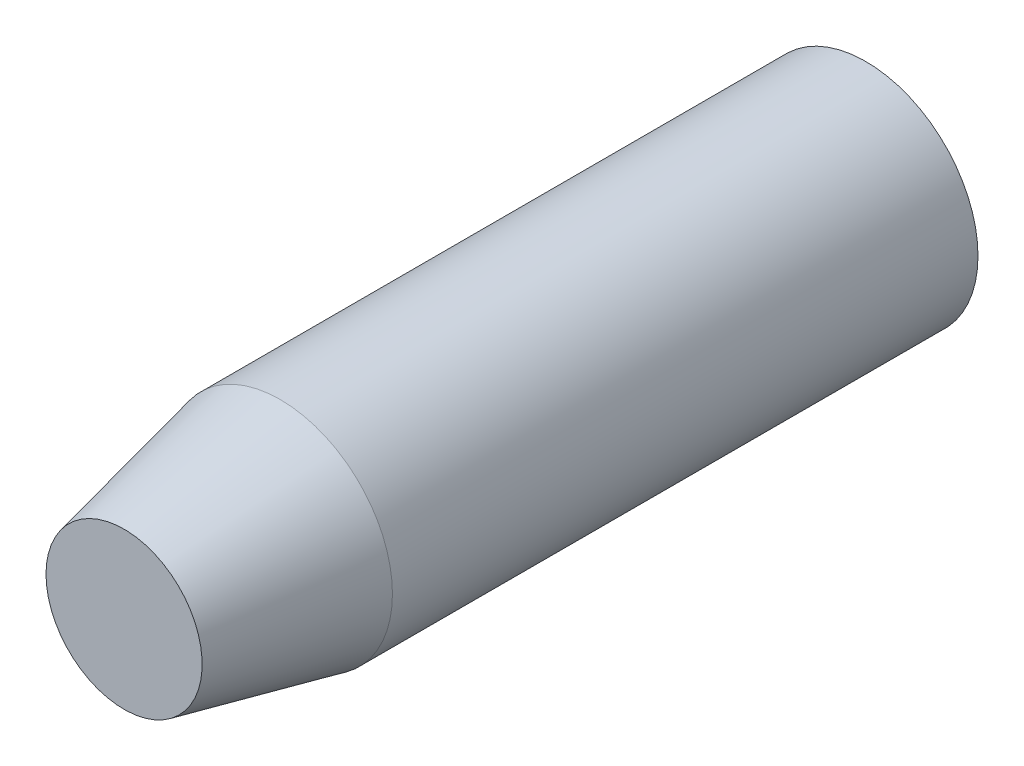
ISO-10303-21;
HEADER;
FILE_DESCRIPTION(('STEP AP214'),'2;1');
FILE_NAME('part.step','',(''),(''),'','','');
FILE_SCHEMA(('AUTOMOTIVE_DESIGN { 1 0 10303 214 1 1 1 1 }'));
ENDSEC;
DATA;
#1=APPLICATION_CONTEXT('core data for automotive mechanical design processes');
#2=APPLICATION_PROTOCOL_DEFINITION('international standard','automotive_design',2000,#1);
#3=PRODUCT_CONTEXT('',#1,'mechanical');
#4=PRODUCT('Part','Part','',(#3));
#5=PRODUCT_RELATED_PRODUCT_CATEGORY('part','',(#4));
#6=PRODUCT_DEFINITION_FORMATION('','',#4);
#7=PRODUCT_DEFINITION_CONTEXT('part definition',#1,'design');
#8=PRODUCT_DEFINITION('design','',#6,#7);
#9=PRODUCT_DEFINITION_SHAPE('','',#8);
#10=(LENGTH_UNIT() NAMED_UNIT(*) SI_UNIT(.MILLI.,.METRE.));
#11=(NAMED_UNIT(*) PLANE_ANGLE_UNIT() SI_UNIT($,.RADIAN.));
#12=(NAMED_UNIT(*) SI_UNIT($,.STERADIAN.) SOLID_ANGLE_UNIT());
#13=UNCERTAINTY_MEASURE_WITH_UNIT(LENGTH_MEASURE(1.E-05),#10,'distance_accuracy_value','');
#14=(GEOMETRIC_REPRESENTATION_CONTEXT(3) GLOBAL_UNCERTAINTY_ASSIGNED_CONTEXT((#13)) GLOBAL_UNIT_ASSIGNED_CONTEXT((#10,
#11,#12)) REPRESENTATION_CONTEXT('',''));
#15=CARTESIAN_POINT('',(0.,0.,0.));
#16=DIRECTION('',(0.,0.,1.));
#17=DIRECTION('',(1.,0.,0.));
#18=AXIS2_PLACEMENT_3D('',#15,#16,#17);
#19=CARTESIAN_POINT('',(0.,0.,60.325));
#20=DIRECTION('',(0.,0.,1.));
#21=DIRECTION('',(1.,0.,0.));
#22=AXIS2_PLACEMENT_3D('',#19,#20,#21);
#23=PLANE('',#22);
#24=CARTESIAN_POINT('',(0.,0.,60.3249999999993));
#25=DIRECTION('',(0.,0.,-1.));
#26=DIRECTION('',(-1.,0.,0.));
#27=AXIS2_PLACEMENT_3D('',#24,#25,#26);
#28=CIRCLE('',#27,12.6999999999966);
#29=CARTESIAN_POINT('',(-12.6999999999966,0.,60.3249999999993));
#30=VERTEX_POINT('',#29);
#31=EDGE_CURVE('E18',#30,#30,#28,.T.);
#32=ORIENTED_EDGE('',*,*,#31,.F.);
#33=EDGE_LOOP('',(#32));
#34=FACE_BOUND('',#33,.T.);
#35=ADVANCED_FACE('F15',(#34),#23,.T.);
#36=CARTESIAN_POINT('',(0.,0.,-60.325));
#37=DIRECTION('',(0.,0.,1.));
#38=DIRECTION('',(1.,0.,0.));
#39=AXIS2_PLACEMENT_3D('',#36,#37,#38);
#40=PLANE('',#39);
#41=CARTESIAN_POINT('',(0.,0.,-60.325));
#42=DIRECTION('',(0.,0.,1.));
#43=DIRECTION('',(1.,0.,0.));
#44=AXIS2_PLACEMENT_3D('',#41,#42,#43);
#45=CIRCLE('',#44,18.25625);
#46=CARTESIAN_POINT('',(18.25625,0.,-60.325));
#47=VERTEX_POINT('',#46);
#48=EDGE_CURVE('E22',#47,#47,#45,.T.);
#49=ORIENTED_EDGE('',*,*,#48,.F.);
#50=EDGE_LOOP('',(#49));
#51=FACE_BOUND('',#50,.T.);
#52=ADVANCED_FACE('F35',(#51),#40,.F.);
#53=CARTESIAN_POINT('',(0.,0.,34.9249999999994));
#54=DIRECTION('',(0.,0.,-1.));
#55=DIRECTION('',(-1.,0.,0.));
#56=AXIS2_PLACEMENT_3D('',#53,#54,#55);
#57=CONICAL_SURFACE('',#56,18.2562499999973,0.215357699697764);
#58=CARTESIAN_POINT('',(0.,0.,34.925));
#59=DIRECTION('',(0.,0.,1.));
#60=DIRECTION('',(1.,0.,0.));
#61=AXIS2_PLACEMENT_3D('',#58,#59,#60);
#62=CIRCLE('',#61,18.25625);
#63=CARTESIAN_POINT('',(18.25625,0.,34.925));
#64=VERTEX_POINT('',#63);
#65=EDGE_CURVE('E10',#64,#64,#62,.F.);
#66=ORIENTED_EDGE('',*,*,#65,.F.);
#67=EDGE_LOOP('',(#66));
#68=FACE_BOUND('',#67,.T.);
#69=ORIENTED_EDGE('',*,*,#31,.T.);
#70=EDGE_LOOP('',(#69));
#71=FACE_BOUND('',#70,.T.);
#72=ADVANCED_FACE('F32',(#68,#71),#57,.T.);
#73=CARTESIAN_POINT('',(0.,0.,-60.325));
#74=DIRECTION('',(0.,0.,1.));
#75=DIRECTION('',(1.,0.,0.));
#76=AXIS2_PLACEMENT_3D('',#73,#74,#75);
#77=CYLINDRICAL_SURFACE('',#76,18.25625);
#78=ORIENTED_EDGE('',*,*,#48,.T.);
#79=EDGE_LOOP('',(#78));
#80=FACE_BOUND('',#79,.T.);
#81=ORIENTED_EDGE('',*,*,#65,.T.);
#82=EDGE_LOOP('',(#81));
#83=FACE_BOUND('',#82,.T.);
#84=ADVANCED_FACE('F41',(#80,#83),#77,.T.);
#85=CLOSED_SHELL('',(#35,#52,#72,#84));
#86=MANIFOLD_SOLID_BREP('B1',#85);
#87=ADVANCED_BREP_SHAPE_REPRESENTATION('',(#18,#86),#14);
#88=SHAPE_DEFINITION_REPRESENTATION(#9,#87);
ENDSEC;
END-ISO-10303-21;
